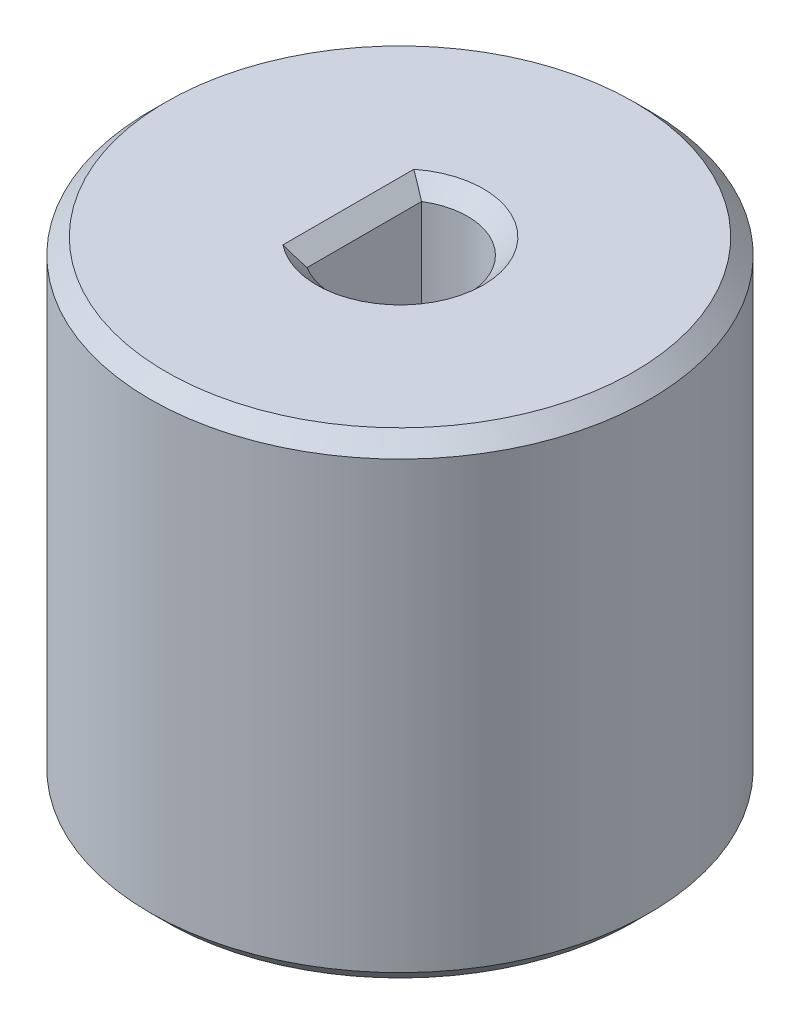
ISO-10303-21;
HEADER;
FILE_DESCRIPTION(('STEP AP214'),'2;1');
FILE_NAME('part.step','',(''),(''),'','','');
FILE_SCHEMA(('AUTOMOTIVE_DESIGN { 1 0 10303 214 1 1 1 1 }'));
ENDSEC;
DATA;
#1=APPLICATION_CONTEXT('core data for automotive mechanical design processes');
#2=APPLICATION_PROTOCOL_DEFINITION('international standard','automotive_design',2000,#1);
#3=PRODUCT_CONTEXT('',#1,'mechanical');
#4=PRODUCT('Part','Part','',(#3));
#5=PRODUCT_RELATED_PRODUCT_CATEGORY('part','',(#4));
#6=PRODUCT_DEFINITION_FORMATION('','',#4);
#7=PRODUCT_DEFINITION_CONTEXT('part definition',#1,'design');
#8=PRODUCT_DEFINITION('design','',#6,#7);
#9=PRODUCT_DEFINITION_SHAPE('','',#8);
#10=(LENGTH_UNIT() NAMED_UNIT(*) SI_UNIT(.MILLI.,.METRE.));
#11=(NAMED_UNIT(*) PLANE_ANGLE_UNIT() SI_UNIT($,.RADIAN.));
#12=(NAMED_UNIT(*) SI_UNIT($,.STERADIAN.) SOLID_ANGLE_UNIT());
#13=UNCERTAINTY_MEASURE_WITH_UNIT(LENGTH_MEASURE(1.E-05),#10,'distance_accuracy_value','');
#14=(GEOMETRIC_REPRESENTATION_CONTEXT(3) GLOBAL_UNCERTAINTY_ASSIGNED_CONTEXT((#13)) GLOBAL_UNIT_ASSIGNED_CONTEXT((#10,
#11,#12)) REPRESENTATION_CONTEXT('',''));
#15=CARTESIAN_POINT('',(0.,0.,0.));
#16=DIRECTION('',(0.,0.,1.));
#17=DIRECTION('',(1.,0.,0.));
#18=AXIS2_PLACEMENT_3D('',#15,#16,#17);
#19=CARTESIAN_POINT('',(0.,30.,0.));
#20=DIRECTION('',(0.,-1.,0.));
#21=DIRECTION('',(0.,0.,-1.));
#22=AXIS2_PLACEMENT_3D('',#19,#20,#21);
#23=CONICAL_SURFACE('',#22,14.725,0.785398163397447);
#24=CARTESIAN_POINT('',(0.,29.,0.));
#25=DIRECTION('',(0.,-1.,0.));
#26=DIRECTION('',(0.,0.,-1.));
#27=AXIS2_PLACEMENT_3D('',#24,#25,#26);
#28=CIRCLE('',#27,15.725);
#29=CARTESIAN_POINT('',(0.,29.,-15.725));
#30=VERTEX_POINT('',#29);
#31=EDGE_CURVE('E118',#30,#30,#28,.T.);
#32=ORIENTED_EDGE('',*,*,#31,.F.);
#33=EDGE_LOOP('',(#32));
#34=FACE_BOUND('',#33,.T.);
#35=CARTESIAN_POINT('',(0.,30.,0.));
#36=DIRECTION('',(0.,-1.,0.));
#37=DIRECTION('',(0.,0.,-1.));
#38=AXIS2_PLACEMENT_3D('',#35,#36,#37);
#39=CIRCLE('',#38,14.725);
#40=CARTESIAN_POINT('',(0.,30.,-14.725));
#41=VERTEX_POINT('',#40);
#42=EDGE_CURVE('E96',#41,#41,#39,.T.);
#43=ORIENTED_EDGE('',*,*,#42,.T.);
#44=EDGE_LOOP('',(#43));
#45=FACE_BOUND('',#44,.T.);
#46=ADVANCED_FACE('F40',(#34,#45),#23,.T.);
#47=CARTESIAN_POINT('',(0.,0.,0.));
#48=DIRECTION('',(0.,-1.,0.));
#49=DIRECTION('',(0.,0.,-1.));
#50=AXIS2_PLACEMENT_3D('',#47,#48,#49);
#51=CYLINDRICAL_SURFACE('',#50,15.725);
#52=CARTESIAN_POINT('',(0.,0.999999999999998,0.));
#53=DIRECTION('',(0.,-1.,0.));
#54=DIRECTION('',(0.,0.,-1.));
#55=AXIS2_PLACEMENT_3D('',#52,#53,#54);
#56=CIRCLE('',#55,15.725);
#57=CARTESIAN_POINT('',(0.,0.999999999999998,-15.725));
#58=VERTEX_POINT('',#57);
#59=EDGE_CURVE('E115',#58,#58,#56,.T.);
#60=ORIENTED_EDGE('',*,*,#59,.F.);
#61=EDGE_LOOP('',(#60));
#62=FACE_BOUND('',#61,.T.);
#63=ORIENTED_EDGE('',*,*,#31,.T.);
#64=EDGE_LOOP('',(#63));
#65=FACE_BOUND('',#64,.T.);
#66=ADVANCED_FACE('F138',(#62,#65),#51,.T.);
#67=CARTESIAN_POINT('',(0.,0.999999999999998,0.));
#68=DIRECTION('',(0.,1.,0.));
#69=DIRECTION('',(0.,0.,1.));
#70=AXIS2_PLACEMENT_3D('',#67,#68,#69);
#71=CONICAL_SURFACE('',#70,15.725,0.785398163397449);
#72=CARTESIAN_POINT('',(0.,0.,0.));
#73=DIRECTION('',(0.,-1.,0.));
#74=DIRECTION('',(0.,0.,-1.));
#75=AXIS2_PLACEMENT_3D('',#72,#73,#74);
#76=CIRCLE('',#75,14.725);
#77=CARTESIAN_POINT('',(0.,0.,-14.725));
#78=VERTEX_POINT('',#77);
#79=EDGE_CURVE('E112',#78,#78,#76,.T.);
#80=ORIENTED_EDGE('',*,*,#79,.F.);
#81=EDGE_LOOP('',(#80));
#82=FACE_BOUND('',#81,.T.);
#83=ORIENTED_EDGE('',*,*,#59,.T.);
#84=EDGE_LOOP('',(#83));
#85=FACE_BOUND('',#84,.T.);
#86=ADVANCED_FACE('F142',(#82,#85),#71,.T.);
#87=CARTESIAN_POINT('',(-14.725,0.,0.));
#88=DIRECTION('',(0.,1.,0.));
#89=DIRECTION('',(0.,0.,1.));
#90=AXIS2_PLACEMENT_3D('',#87,#88,#89);
#91=PLANE('',#90);
#92=CARTESIAN_POINT('',(0.,0.,0.));
#93=DIRECTION('',(0.,-1.,0.));
#94=DIRECTION('',(0.,0.,-1.));
#95=AXIS2_PLACEMENT_3D('',#92,#93,#94);
#96=CIRCLE('',#95,13.725);
#97=CARTESIAN_POINT('',(0.,0.,-13.725));
#98=VERTEX_POINT('',#97);
#99=EDGE_CURVE('E109',#98,#98,#96,.T.);
#100=ORIENTED_EDGE('',*,*,#99,.F.);
#101=EDGE_LOOP('',(#100));
#102=FACE_BOUND('',#101,.T.);
#103=ORIENTED_EDGE('',*,*,#79,.T.);
#104=EDGE_LOOP('',(#103));
#105=FACE_BOUND('',#104,.T.);
#106=ADVANCED_FACE('F146',(#102,#105),#91,.F.);
#107=CARTESIAN_POINT('',(0.,0.,0.));
#108=DIRECTION('',(0.,-1.,0.));
#109=DIRECTION('',(0.,0.,-1.));
#110=AXIS2_PLACEMENT_3D('',#107,#108,#109);
#111=CONICAL_SURFACE('',#110,13.725,0.785398163397449);
#112=CARTESIAN_POINT('',(0.,0.999999999999998,0.));
#113=DIRECTION('',(0.,-1.,0.));
#114=DIRECTION('',(0.,0.,-1.));
#115=AXIS2_PLACEMENT_3D('',#112,#113,#114);
#116=CIRCLE('',#115,12.725);
#117=CARTESIAN_POINT('',(0.,0.999999999999998,-12.725));
#118=VERTEX_POINT('',#117);
#119=EDGE_CURVE('E106',#118,#118,#116,.T.);
#120=ORIENTED_EDGE('',*,*,#119,.F.);
#121=EDGE_LOOP('',(#120));
#122=FACE_BOUND('',#121,.T.);
#123=ORIENTED_EDGE('',*,*,#99,.T.);
#124=EDGE_LOOP('',(#123));
#125=FACE_BOUND('',#124,.T.);
#126=ADVANCED_FACE('F150',(#122,#125),#111,.F.);
#127=CARTESIAN_POINT('',(0.,0.,0.));
#128=DIRECTION('',(0.,-1.,0.));
#129=DIRECTION('',(0.,0.,-1.));
#130=AXIS2_PLACEMENT_3D('',#127,#128,#129);
#131=CYLINDRICAL_SURFACE('',#130,12.725);
#132=CARTESIAN_POINT('',(0.,14.,0.));
#133=DIRECTION('',(0.,-1.,0.));
#134=DIRECTION('',(0.,0.,-1.));
#135=AXIS2_PLACEMENT_3D('',#132,#133,#134);
#136=CIRCLE('',#135,12.725);
#137=CARTESIAN_POINT('',(0.,14.,-12.725));
#138=VERTEX_POINT('',#137);
#139=EDGE_CURVE('E99',#138,#138,#136,.T.);
#140=ORIENTED_EDGE('',*,*,#139,.F.);
#141=EDGE_LOOP('',(#140));
#142=FACE_BOUND('',#141,.T.);
#143=ORIENTED_EDGE('',*,*,#119,.T.);
#144=EDGE_LOOP('',(#143));
#145=FACE_BOUND('',#144,.T.);
#146=ADVANCED_FACE('F154',(#142,#145),#131,.F.);
#147=CARTESIAN_POINT('',(0.,14.,0.));
#148=DIRECTION('',(0.,-1.,0.));
#149=DIRECTION('',(0.,0.,-1.));
#150=AXIS2_PLACEMENT_3D('',#147,#148,#149);
#151=CONICAL_SURFACE('',#150,12.725,0.78539816339745);
#152=CARTESIAN_POINT('',(0.,15.,0.));
#153=DIRECTION('',(0.,-1.,0.));
#154=DIRECTION('',(0.,0.,-1.));
#155=AXIS2_PLACEMENT_3D('',#152,#153,#154);
#156=CIRCLE('',#155,11.725);
#157=CARTESIAN_POINT('',(0.,15.,-11.725));
#158=VERTEX_POINT('',#157);
#159=EDGE_CURVE('E95',#158,#158,#156,.T.);
#160=ORIENTED_EDGE('',*,*,#159,.F.);
#161=EDGE_LOOP('',(#160));
#162=FACE_BOUND('',#161,.T.);
#163=ORIENTED_EDGE('',*,*,#139,.T.);
#164=EDGE_LOOP('',(#163));
#165=FACE_BOUND('',#164,.T.);
#166=ADVANCED_FACE('F158',(#162,#165),#151,.F.);
#167=CARTESIAN_POINT('',(-11.725,15.,0.));
#168=DIRECTION('',(0.,1.,0.));
#169=DIRECTION('',(0.,0.,1.));
#170=AXIS2_PLACEMENT_3D('',#167,#168,#169);
#171=PLANE('',#170);
#172=DIRECTION('',(0.,0.,-1.));
#173=VECTOR('',#172,1.);
#174=CARTESIAN_POINT('',(-2.25,15.,-3.60555127546399));
#175=LINE('',#174,#173);
#176=CARTESIAN_POINT('',(-2.25,15.,3.60555127546399));
#177=VERTEX_POINT('',#176);
#178=CARTESIAN_POINT('',(-2.25,15.,-3.60555127546399));
#179=VERTEX_POINT('',#178);
#180=EDGE_CURVE('E79',#177,#179,#175,.T.);
#181=ORIENTED_EDGE('',*,*,#180,.F.);
#182=CARTESIAN_POINT('',(0.,15.,0.));
#183=DIRECTION('',(0.,-1.,0.));
#184=DIRECTION('',(0.,0.,-1.));
#185=AXIS2_PLACEMENT_3D('',#182,#183,#184);
#186=CIRCLE('',#185,4.25);
#187=EDGE_CURVE('E91',#179,#177,#186,.T.);
#188=ORIENTED_EDGE('',*,*,#187,.F.);
#189=EDGE_LOOP('',(#181,#188));
#190=FACE_BOUND('',#189,.T.);
#191=ORIENTED_EDGE('',*,*,#159,.T.);
#192=EDGE_LOOP('',(#191));
#193=FACE_BOUND('',#192,.T.);
#194=ADVANCED_FACE('F93',(#190,#193),#171,.F.);
#195=CARTESIAN_POINT('',(0.,0.,0.));
#196=DIRECTION('',(0.,-1.,0.));
#197=DIRECTION('',(0.,0.,-1.));
#198=AXIS2_PLACEMENT_3D('',#195,#196,#197);
#199=CYLINDRICAL_SURFACE('',#198,4.25);
#200=DIRECTION('',(0.,1.,0.));
#201=VECTOR('',#200,1.);
#202=CARTESIAN_POINT('',(-2.25,15.,3.60555127546399));
#203=LINE('',#202,#201);
#204=CARTESIAN_POINT('',(-2.25,29.,3.60555127546399));
#205=VERTEX_POINT('',#204);
#206=EDGE_CURVE('E83',#177,#205,#203,.T.);
#207=ORIENTED_EDGE('',*,*,#206,.T.);
#208=CARTESIAN_POINT('',(0.,29.,0.));
#209=DIRECTION('',(0.,-1.,0.));
#210=DIRECTION('',(0.,0.,-1.));
#211=AXIS2_PLACEMENT_3D('',#208,#209,#210);
#212=CIRCLE('',#211,4.25);
#213=CARTESIAN_POINT('',(-2.25,29.,-3.60555127546399));
#214=VERTEX_POINT('',#213);
#215=EDGE_CURVE('E54',#205,#214,#212,.F.);
#216=ORIENTED_EDGE('',*,*,#215,.T.);
#217=DIRECTION('',(0.,1.,0.));
#218=VECTOR('',#217,1.);
#219=CARTESIAN_POINT('',(-2.25,15.,-3.60555127546399));
#220=LINE('',#219,#218);
#221=EDGE_CURVE('E82',#179,#214,#220,.T.);
#222=ORIENTED_EDGE('',*,*,#221,.F.);
#223=ORIENTED_EDGE('',*,*,#187,.T.);
#224=EDGE_LOOP('',(#207,#216,#222,#223));
#225=FACE_BOUND('',#224,.T.);
#226=ADVANCED_FACE('F90',(#225),#199,.F.);
#227=CARTESIAN_POINT('',(-4.25,30.,0.));
#228=DIRECTION('',(0.,-1.,0.));
#229=DIRECTION('',(0.,0.,-1.));
#230=AXIS2_PLACEMENT_3D('',#227,#228,#229);
#231=PLANE('',#230);
#232=DIRECTION('',(0.,0.,-1.));
#233=VECTOR('',#232,1.);
#234=CARTESIAN_POINT('',(-3.24999999999999,30.,-3.60555127546399));
#235=LINE('',#234,#233);
#236=CARTESIAN_POINT('',(-3.24999999999999,30.,4.12310562561766));
#237=VERTEX_POINT('',#236);
#238=CARTESIAN_POINT('',(-3.24999999999999,30.,-4.12310562561766));
#239=VERTEX_POINT('',#238);
#240=EDGE_CURVE('E121',#237,#239,#235,.T.);
#241=ORIENTED_EDGE('',*,*,#240,.T.);
#242=CARTESIAN_POINT('',(0.,30.,0.));
#243=DIRECTION('',(0.,-1.,0.));
#244=DIRECTION('',(0.,0.,-1.));
#245=AXIS2_PLACEMENT_3D('',#242,#243,#244);
#246=CIRCLE('',#245,5.24999999999999);
#247=EDGE_CURVE('E123',#239,#237,#246,.T.);
#248=ORIENTED_EDGE('',*,*,#247,.T.);
#249=EDGE_LOOP('',(#241,#248));
#250=FACE_BOUND('',#249,.T.);
#251=ORIENTED_EDGE('',*,*,#42,.F.);
#252=EDGE_LOOP('',(#251));
#253=FACE_BOUND('',#252,.T.);
#254=ADVANCED_FACE('F167',(#250,#253),#231,.F.);
#255=CARTESIAN_POINT('',(-2.25,15.,-3.60555127546399));
#256=DIRECTION('',(1.,0.,0.));
#257=DIRECTION('',(0.,0.,-1.));
#258=AXIS2_PLACEMENT_3D('',#255,#256,#257);
#259=PLANE('',#258);
#260=ORIENTED_EDGE('',*,*,#221,.T.);
#261=DIRECTION('',(0.,0.,1.));
#262=VECTOR('',#261,1.);
#263=CARTESIAN_POINT('',(-2.25,29.,3.60555127546399));
#264=LINE('',#263,#262);
#265=EDGE_CURVE('E11',#214,#205,#264,.T.);
#266=ORIENTED_EDGE('',*,*,#265,.T.);
#267=ORIENTED_EDGE('',*,*,#206,.F.);
#268=ORIENTED_EDGE('',*,*,#180,.T.);
#269=EDGE_LOOP('',(#260,#266,#267,#268));
#270=FACE_BOUND('',#269,.T.);
#271=ADVANCED_FACE('F81',(#270),#259,.T.);
#272=CARTESIAN_POINT('',(-3.24999999999999,30.,0.));
#273=DIRECTION('',(0.70710678118655,0.707106781186545,0.));
#274=DIRECTION('',(0.,0.,1.));
#275=AXIS2_PLACEMENT_3D('',#272,#273,#274);
#276=PLANE('',#275);
#277=CARTESIAN_POINT('',(-3.24999999999999,30.,4.12310562561766));
#278=CARTESIAN_POINT('',(-3.1660525487724,29.9160525487724,4.08238278184767));
#279=CARTESIAN_POINT('',(-3.08223431191164,29.8322343119116,4.04112402823364));
#280=CARTESIAN_POINT('',(-2.91489989447325,29.6648998944733,3.95744294654459));
#281=CARTESIAN_POINT('',(-2.83138367979719,29.5813836797972,3.915020754779));
#282=CARTESIAN_POINT('',(-2.66467485271646,29.4146748527165,3.82891030510317));
#283=CARTESIAN_POINT('',(-2.58148225000746,29.3314822500075,3.78522200958583));
#284=CARTESIAN_POINT('',(-2.41545739003327,29.1654573900333,3.69645675381351));
#285=CARTESIAN_POINT('',(-2.33262517597522,29.0826251759752,3.65137963201705));
#286=CARTESIAN_POINT('',(-2.25,29.,3.60555127546399));
#287=B_SPLINE_CURVE_WITH_KNOTS('',3,(#277,#278,#279,#280,#281,#282,#283,#284,#285,#286),
.UNSPECIFIED.,.F.,.F.,(4,2,2,2,4),(0.,0.376529465472833,0.753015003313859,1.12951173539583,
1.50605242629978),.UNSPECIFIED.);
#288=EDGE_CURVE('E126',#205,#237,#287,.F.);
#289=ORIENTED_EDGE('',*,*,#288,.F.);
#290=ORIENTED_EDGE('',*,*,#265,.F.);
#291=CARTESIAN_POINT('',(-2.25,29.,-3.60555127546399));
#292=CARTESIAN_POINT('',(-2.33262517597522,29.0826251759752,-3.65137963201705));
#293=CARTESIAN_POINT('',(-2.41545739003327,29.1654573900333,-3.69645675381351));
#294=CARTESIAN_POINT('',(-2.58148225000746,29.3314822500075,-3.78522200958583));
#295=CARTESIAN_POINT('',(-2.66467485271646,29.4146748527165,-3.82891030510317));
#296=CARTESIAN_POINT('',(-2.83138367979719,29.5813836797972,-3.915020754779));
#297=CARTESIAN_POINT('',(-2.91489989447325,29.6648998944733,-3.9574429465446));
#298=CARTESIAN_POINT('',(-3.08223431191164,29.8322343119116,-4.04112402823364));
#299=CARTESIAN_POINT('',(-3.1660525487724,29.9160525487724,-4.08238278184767));
#300=CARTESIAN_POINT('',(-3.24999999999999,30.,-4.12310562561766));
#301=B_SPLINE_CURVE_WITH_KNOTS('',3,(#291,#292,#293,#294,#295,#296,#297,#298,#299,#300),
.UNSPECIFIED.,.F.,.F.,(4,2,2,2,4),(0.,0.376540690903949,0.753037422985924,1.12952296082695,
1.50605242629978),.UNSPECIFIED.);
#302=EDGE_CURVE('E45',#239,#214,#301,.F.);
#303=ORIENTED_EDGE('',*,*,#302,.F.);
#304=ORIENTED_EDGE('',*,*,#240,.F.);
#305=EDGE_LOOP('',(#289,#290,#303,#304));
#306=FACE_BOUND('',#305,.T.);
#307=ADVANCED_FACE('F42',(#306),#276,.T.);
#308=CARTESIAN_POINT('',(0.,30.,0.));
#309=DIRECTION('',(0.,1.,0.));
#310=DIRECTION('',(0.,0.,1.));
#311=AXIS2_PLACEMENT_3D('',#308,#309,#310);
#312=CONICAL_SURFACE('',#311,5.24999999999999,0.785398163397445);
#313=ORIENTED_EDGE('',*,*,#302,.T.);
#314=ORIENTED_EDGE('',*,*,#215,.F.);
#315=ORIENTED_EDGE('',*,*,#288,.T.);
#316=ORIENTED_EDGE('',*,*,#247,.F.);
#317=EDGE_LOOP('',(#313,#314,#315,#316));
#318=FACE_BOUND('',#317,.T.);
#319=ADVANCED_FACE('F131',(#318),#312,.F.);
#320=CLOSED_SHELL('',(#46,#66,#86,#106,#126,#146,#166,#194,#226,#254,#271,#307,#319));
#321=MANIFOLD_SOLID_BREP('B2',#320);
#322=ADVANCED_BREP_SHAPE_REPRESENTATION('',(#18,#321),#14);
#323=SHAPE_DEFINITION_REPRESENTATION(#9,#322);
ENDSEC;
END-ISO-10303-21;
